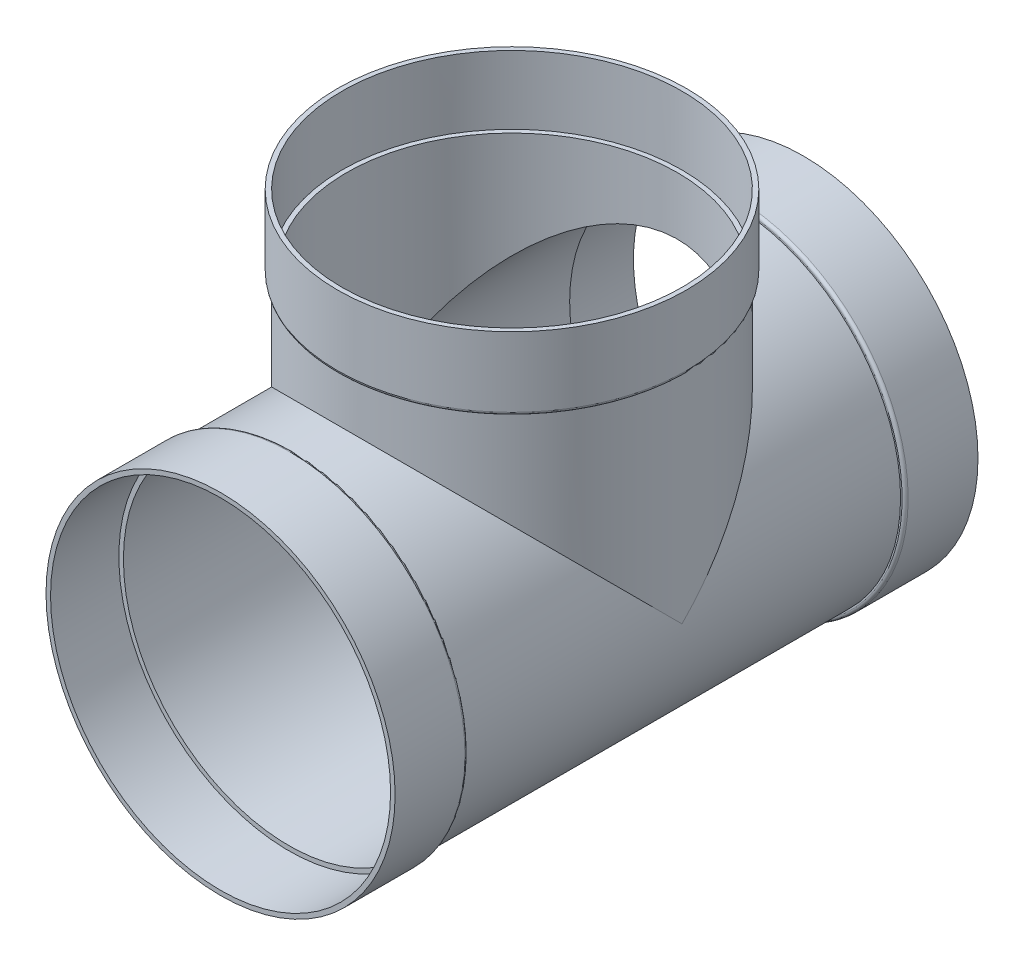
ISO-10303-21;
HEADER;
FILE_DESCRIPTION(('STEP AP214'),'2;1');
FILE_NAME('part.step','',(''),(''),'','','');
FILE_SCHEMA(('AUTOMOTIVE_DESIGN { 1 0 10303 214 1 1 1 1 }'));
ENDSEC;
DATA;
#1=APPLICATION_CONTEXT('core data for automotive mechanical design processes');
#2=APPLICATION_PROTOCOL_DEFINITION('international standard','automotive_design',2000,#1);
#3=PRODUCT_CONTEXT('',#1,'mechanical');
#4=PRODUCT('Part','Part','',(#3));
#5=PRODUCT_RELATED_PRODUCT_CATEGORY('part','',(#4));
#6=PRODUCT_DEFINITION_FORMATION('','',#4);
#7=PRODUCT_DEFINITION_CONTEXT('part definition',#1,'design');
#8=PRODUCT_DEFINITION('design','',#6,#7);
#9=PRODUCT_DEFINITION_SHAPE('','',#8);
#10=(LENGTH_UNIT() NAMED_UNIT(*) SI_UNIT(.MILLI.,.METRE.));
#11=(NAMED_UNIT(*) PLANE_ANGLE_UNIT() SI_UNIT($,.RADIAN.));
#12=(NAMED_UNIT(*) SI_UNIT($,.STERADIAN.) SOLID_ANGLE_UNIT());
#13=UNCERTAINTY_MEASURE_WITH_UNIT(LENGTH_MEASURE(1.E-05),#10,'distance_accuracy_value','');
#14=(GEOMETRIC_REPRESENTATION_CONTEXT(3) GLOBAL_UNCERTAINTY_ASSIGNED_CONTEXT((#13)) GLOBAL_UNIT_ASSIGNED_CONTEXT((#10,
#11,#12)) REPRESENTATION_CONTEXT('',''));
#15=CARTESIAN_POINT('',(0.,0.,0.));
#16=DIRECTION('',(0.,0.,1.));
#17=DIRECTION('',(1.,0.,0.));
#18=AXIS2_PLACEMENT_3D('',#15,#16,#17);
#19=CARTESIAN_POINT('',(0.,0.,304.8));
#20=DIRECTION('',(0.,0.,-1.));
#21=DIRECTION('',(-1.,0.,0.));
#22=AXIS2_PLACEMENT_3D('',#19,#20,#21);
#23=PLANE('',#22);
#24=CARTESIAN_POINT('',(0.,0.,304.8));
#25=DIRECTION('',(0.,0.,-1.));
#26=DIRECTION('',(-1.,0.,0.));
#27=AXIS2_PLACEMENT_3D('',#24,#25,#26);
#28=CIRCLE('',#27,177.8);
#29=CARTESIAN_POINT('',(-177.8,0.,304.8));
#30=VERTEX_POINT('',#29);
#31=EDGE_CURVE('E85',#30,#30,#28,.F.);
#32=ORIENTED_EDGE('',*,*,#31,.F.);
#33=EDGE_LOOP('',(#32));
#34=FACE_BOUND('',#33,.T.);
#35=CARTESIAN_POINT('',(0.,0.,304.8));
#36=DIRECTION('',(0.,0.,1.));
#37=DIRECTION('',(1.,0.,0.));
#38=AXIS2_PLACEMENT_3D('',#35,#36,#37);
#39=CIRCLE('',#38,182.5498);
#40=CARTESIAN_POINT('',(182.5498,0.,304.8));
#41=VERTEX_POINT('',#40);
#42=EDGE_CURVE('E142',#41,#41,#39,.T.);
#43=ORIENTED_EDGE('',*,*,#42,.T.);
#44=EDGE_LOOP('',(#43));
#45=FACE_BOUND('',#44,.T.);
#46=ADVANCED_FACE('F52',(#34,#45),#23,.F.);
#47=CARTESIAN_POINT('',(0.,0.,168.70511138535));
#48=DIRECTION('',(0.,0.,1.));
#49=DIRECTION('',(1.,0.,0.));
#50=AXIS2_PLACEMENT_3D('',#47,#48,#49);
#51=CYLINDRICAL_SURFACE('',#50,182.5498);
#52=CARTESIAN_POINT('',(0.,0.,231.775));
#53=DIRECTION('',(0.,0.,1.));
#54=DIRECTION('',(1.,0.,0.));
#55=AXIS2_PLACEMENT_3D('',#52,#53,#54);
#56=CIRCLE('',#55,182.5498);
#57=CARTESIAN_POINT('',(182.5498,0.,231.775));
#58=VERTEX_POINT('',#57);
#59=EDGE_CURVE('E158',#58,#58,#56,.T.);
#60=ORIENTED_EDGE('',*,*,#59,.T.);
#61=EDGE_LOOP('',(#60));
#62=FACE_BOUND('',#61,.T.);
#63=ORIENTED_EDGE('',*,*,#42,.F.);
#64=EDGE_LOOP('',(#63));
#65=FACE_BOUND('',#64,.T.);
#66=ADVANCED_FACE('F183',(#62,#65),#51,.T.);
#67=CARTESIAN_POINT('',(0.,182.5498,228.6));
#68=DIRECTION('',(0.,0.,1.));
#69=DIRECTION('',(1.,0.,0.));
#70=AXIS2_PLACEMENT_3D('',#67,#68,#69);
#71=PLANE('',#70);
#72=CARTESIAN_POINT('',(0.,0.,228.6));
#73=DIRECTION('',(0.,0.,1.));
#74=DIRECTION('',(1.,0.,0.));
#75=AXIS2_PLACEMENT_3D('',#72,#73,#74);
#76=CIRCLE('',#75,179.3748);
#77=CARTESIAN_POINT('',(179.3748,0.,228.6));
#78=VERTEX_POINT('',#77);
#79=EDGE_CURVE('E162',#78,#78,#76,.F.);
#80=ORIENTED_EDGE('',*,*,#79,.T.);
#81=EDGE_LOOP('',(#80));
#82=FACE_BOUND('',#81,.T.);
#83=CARTESIAN_POINT('',(0.,0.,228.6));
#84=DIRECTION('',(0.,0.,1.));
#85=DIRECTION('',(1.,0.,0.));
#86=AXIS2_PLACEMENT_3D('',#83,#84,#85);
#87=CIRCLE('',#86,177.8);
#88=CARTESIAN_POINT('',(177.8,0.,228.6));
#89=VERTEX_POINT('',#88);
#90=EDGE_CURVE('E138',#89,#89,#87,.T.);
#91=ORIENTED_EDGE('',*,*,#90,.T.);
#92=EDGE_LOOP('',(#91));
#93=FACE_BOUND('',#92,.T.);
#94=ADVANCED_FACE('F189',(#82,#93),#71,.F.);
#95=CARTESIAN_POINT('',(0.,0.,168.70511138535));
#96=DIRECTION('',(0.,0.,1.));
#97=DIRECTION('',(1.,0.,0.));
#98=AXIS2_PLACEMENT_3D('',#95,#96,#97);
#99=CYLINDRICAL_SURFACE('',#98,177.8);
#100=CARTESIAN_POINT('',(0.,0.,0.));
#101=DIRECTION('',(0.,-0.707106781186547,0.707106781186547));
#102=DIRECTION('',(0.,0.707106781186547,0.707106781186547));
#103=AXIS2_PLACEMENT_3D('',#100,#101,#102);
#104=ELLIPSE('',#103,251.447171389936,177.8);
#105=CARTESIAN_POINT('',(177.8,0.,0.));
#106=VERTEX_POINT('',#105);
#107=CARTESIAN_POINT('',(-177.8,0.,0.));
#108=VERTEX_POINT('',#107);
#109=EDGE_CURVE('E70',#106,#108,#104,.T.);
#110=ORIENTED_EDGE('',*,*,#109,.T.);
#111=CARTESIAN_POINT('',(0.,0.,0.));
#112=DIRECTION('',(0.,0.707106781186547,0.707106781186547));
#113=DIRECTION('',(0.,-0.707106781186547,0.707106781186547));
#114=AXIS2_PLACEMENT_3D('',#111,#112,#113);
#115=ELLIPSE('',#114,251.447171389936,177.8);
#116=EDGE_CURVE('E67',#108,#106,#115,.F.);
#117=ORIENTED_EDGE('',*,*,#116,.T.);
#118=EDGE_LOOP('',(#110,#117));
#119=FACE_BOUND('',#118,.T.);
#120=ORIENTED_EDGE('',*,*,#90,.F.);
#121=EDGE_LOOP('',(#120));
#122=FACE_BOUND('',#121,.T.);
#123=CARTESIAN_POINT('',(0.,0.,-228.6));
#124=DIRECTION('',(0.,0.,1.));
#125=DIRECTION('',(1.,0.,0.));
#126=AXIS2_PLACEMENT_3D('',#123,#124,#125);
#127=CIRCLE('',#126,177.8);
#128=CARTESIAN_POINT('',(177.8,0.,-228.6));
#129=VERTEX_POINT('',#128);
#130=EDGE_CURVE('E134',#129,#129,#127,.T.);
#131=ORIENTED_EDGE('',*,*,#130,.T.);
#132=EDGE_LOOP('',(#131));
#133=FACE_BOUND('',#132,.T.);
#134=ADVANCED_FACE('F213',(#119,#122,#133),#99,.T.);
#135=CARTESIAN_POINT('',(0.,182.5498,-228.6));
#136=DIRECTION('',(0.,0.,-1.));
#137=DIRECTION('',(-1.,0.,0.));
#138=AXIS2_PLACEMENT_3D('',#135,#136,#137);
#139=PLANE('',#138);
#140=CARTESIAN_POINT('',(0.,0.,-228.6));
#141=DIRECTION('',(0.,0.,-1.));
#142=DIRECTION('',(-1.,0.,0.));
#143=AXIS2_PLACEMENT_3D('',#140,#141,#142);
#144=CIRCLE('',#143,179.3748);
#145=CARTESIAN_POINT('',(-179.3748,0.,-228.6));
#146=VERTEX_POINT('',#145);
#147=EDGE_CURVE('E150',#146,#146,#144,.F.);
#148=ORIENTED_EDGE('',*,*,#147,.T.);
#149=EDGE_LOOP('',(#148));
#150=FACE_BOUND('',#149,.T.);
#151=ORIENTED_EDGE('',*,*,#130,.F.);
#152=EDGE_LOOP('',(#151));
#153=FACE_BOUND('',#152,.T.);
#154=ADVANCED_FACE('F209',(#150,#153),#139,.F.);
#155=CARTESIAN_POINT('',(0.,0.,168.70511138535));
#156=DIRECTION('',(0.,0.,1.));
#157=DIRECTION('',(1.,0.,0.));
#158=AXIS2_PLACEMENT_3D('',#155,#156,#157);
#159=CYLINDRICAL_SURFACE('',#158,182.5498);
#160=CARTESIAN_POINT('',(0.,0.,-231.775));
#161=DIRECTION('',(0.,0.,-1.));
#162=DIRECTION('',(-1.,0.,0.));
#163=AXIS2_PLACEMENT_3D('',#160,#161,#162);
#164=CIRCLE('',#163,182.5498);
#165=CARTESIAN_POINT('',(-182.5498,0.,-231.775));
#166=VERTEX_POINT('',#165);
#167=EDGE_CURVE('E154',#166,#166,#164,.T.);
#168=ORIENTED_EDGE('',*,*,#167,.T.);
#169=EDGE_LOOP('',(#168));
#170=FACE_BOUND('',#169,.T.);
#171=CARTESIAN_POINT('',(0.,0.,-304.8));
#172=DIRECTION('',(0.,0.,1.));
#173=DIRECTION('',(1.,0.,0.));
#174=AXIS2_PLACEMENT_3D('',#171,#172,#173);
#175=CIRCLE('',#174,182.5498);
#176=CARTESIAN_POINT('',(182.5498,0.,-304.8));
#177=VERTEX_POINT('',#176);
#178=EDGE_CURVE('E130',#177,#177,#175,.T.);
#179=ORIENTED_EDGE('',*,*,#178,.T.);
#180=EDGE_LOOP('',(#179));
#181=FACE_BOUND('',#180,.T.);
#182=ADVANCED_FACE('F212',(#170,#181),#159,.T.);
#183=CARTESIAN_POINT('',(0.,182.5498,-304.8));
#184=DIRECTION('',(0.,0.,1.));
#185=DIRECTION('',(1.,0.,0.));
#186=AXIS2_PLACEMENT_3D('',#183,#184,#185);
#187=PLANE('',#186);
#188=CARTESIAN_POINT('',(0.,0.,-304.8));
#189=DIRECTION('',(0.,0.,1.));
#190=DIRECTION('',(1.,0.,0.));
#191=AXIS2_PLACEMENT_3D('',#188,#189,#190);
#192=CIRCLE('',#191,177.8);
#193=CARTESIAN_POINT('',(177.8,0.,-304.8));
#194=VERTEX_POINT('',#193);
#195=EDGE_CURVE('E107',#194,#194,#192,.T.);
#196=ORIENTED_EDGE('',*,*,#195,.T.);
#197=EDGE_LOOP('',(#196));
#198=FACE_BOUND('',#197,.T.);
#199=ORIENTED_EDGE('',*,*,#178,.F.);
#200=EDGE_LOOP('',(#199));
#201=FACE_BOUND('',#200,.T.);
#202=ADVANCED_FACE('F228',(#198,#201),#187,.F.);
#203=CARTESIAN_POINT('',(0.,0.,0.));
#204=DIRECTION('',(0.,1.,0.));
#205=DIRECTION('',(0.,0.,1.));
#206=AXIS2_PLACEMENT_3D('',#203,#204,#205);
#207=CYLINDRICAL_SURFACE('',#206,177.8);
#208=CARTESIAN_POINT('',(0.,228.6,0.));
#209=DIRECTION('',(0.,1.,0.));
#210=DIRECTION('',(0.,0.,1.));
#211=AXIS2_PLACEMENT_3D('',#208,#209,#210);
#212=CIRCLE('',#211,177.8);
#213=CARTESIAN_POINT('',(0.,228.6,177.8));
#214=VERTEX_POINT('',#213);
#215=EDGE_CURVE('E89',#214,#214,#212,.T.);
#216=ORIENTED_EDGE('',*,*,#215,.F.);
#217=EDGE_LOOP('',(#216));
#218=FACE_BOUND('',#217,.T.);
#219=ORIENTED_EDGE('',*,*,#116,.F.);
#220=ORIENTED_EDGE('',*,*,#109,.F.);
#221=EDGE_LOOP('',(#219,#220));
#222=FACE_BOUND('',#221,.T.);
#223=ADVANCED_FACE('F232',(#218,#222),#207,.T.);
#224=CARTESIAN_POINT('',(0.,304.8,0.));
#225=DIRECTION('',(0.,1.,0.));
#226=DIRECTION('',(0.,0.,1.));
#227=AXIS2_PLACEMENT_3D('',#224,#225,#226);
#228=PLANE('',#227);
#229=CARTESIAN_POINT('',(0.,304.8,0.));
#230=DIRECTION('',(0.,1.,0.));
#231=DIRECTION('',(0.,0.,1.));
#232=AXIS2_PLACEMENT_3D('',#229,#230,#231);
#233=CIRCLE('',#232,177.8);
#234=CARTESIAN_POINT('',(0.,304.8,177.8));
#235=VERTEX_POINT('',#234);
#236=EDGE_CURVE('E116',#235,#235,#233,.T.);
#237=ORIENTED_EDGE('',*,*,#236,.F.);
#238=EDGE_LOOP('',(#237));
#239=FACE_BOUND('',#238,.T.);
#240=CARTESIAN_POINT('',(0.,304.8,0.));
#241=DIRECTION('',(0.,1.,0.));
#242=DIRECTION('',(0.,0.,1.));
#243=AXIS2_PLACEMENT_3D('',#240,#241,#242);
#244=CIRCLE('',#243,182.5498);
#245=CARTESIAN_POINT('',(0.,304.8,182.5498));
#246=VERTEX_POINT('',#245);
#247=EDGE_CURVE('E94',#246,#246,#244,.T.);
#248=ORIENTED_EDGE('',*,*,#247,.T.);
#249=EDGE_LOOP('',(#248));
#250=FACE_BOUND('',#249,.T.);
#251=ADVANCED_FACE('F234',(#239,#250),#228,.T.);
#252=CARTESIAN_POINT('',(0.,0.,0.));
#253=DIRECTION('',(0.,1.,0.));
#254=DIRECTION('',(0.,0.,1.));
#255=AXIS2_PLACEMENT_3D('',#252,#253,#254);
#256=CYLINDRICAL_SURFACE('',#255,182.5498);
#257=CARTESIAN_POINT('',(0.,231.775,0.));
#258=DIRECTION('',(0.,-1.,0.));
#259=DIRECTION('',(0.,0.,-1.));
#260=AXIS2_PLACEMENT_3D('',#257,#258,#259);
#261=CIRCLE('',#260,182.5498);
#262=CARTESIAN_POINT('',(0.,231.775,-182.5498));
#263=VERTEX_POINT('',#262);
#264=EDGE_CURVE('E61',#263,#263,#261,.F.);
#265=ORIENTED_EDGE('',*,*,#264,.T.);
#266=EDGE_LOOP('',(#265));
#267=FACE_BOUND('',#266,.T.);
#268=ORIENTED_EDGE('',*,*,#247,.F.);
#269=EDGE_LOOP('',(#268));
#270=FACE_BOUND('',#269,.T.);
#271=ADVANCED_FACE('F170',(#267,#270),#256,.T.);
#272=CARTESIAN_POINT('',(0.,228.6,182.5498));
#273=DIRECTION('',(0.,-1.,0.));
#274=DIRECTION('',(0.,0.,-1.));
#275=AXIS2_PLACEMENT_3D('',#272,#273,#274);
#276=PLANE('',#275);
#277=CARTESIAN_POINT('',(0.,228.6,0.));
#278=DIRECTION('',(0.,-1.,0.));
#279=DIRECTION('',(0.,0.,-1.));
#280=AXIS2_PLACEMENT_3D('',#277,#278,#279);
#281=CIRCLE('',#280,179.3748);
#282=CARTESIAN_POINT('',(0.,228.6,-179.3748));
#283=VERTEX_POINT('',#282);
#284=EDGE_CURVE('E13',#283,#283,#281,.T.);
#285=ORIENTED_EDGE('',*,*,#284,.T.);
#286=EDGE_LOOP('',(#285));
#287=FACE_BOUND('',#286,.T.);
#288=ORIENTED_EDGE('',*,*,#215,.T.);
#289=EDGE_LOOP('',(#288));
#290=FACE_BOUND('',#289,.T.);
#291=ADVANCED_FACE('F240',(#287,#290),#276,.T.);
#292=CARTESIAN_POINT('',(0.,0.,168.70511138535));
#293=DIRECTION('',(0.,0.,1.));
#294=DIRECTION('',(1.,0.,0.));
#295=AXIS2_PLACEMENT_3D('',#292,#293,#294);
#296=CYLINDRICAL_SURFACE('',#295,177.8);
#297=ORIENTED_EDGE('',*,*,#31,.T.);
#298=EDGE_LOOP('',(#297));
#299=FACE_BOUND('',#298,.T.);
#300=CARTESIAN_POINT('',(0.,0.,233.3498));
#301=DIRECTION('',(0.,0.,1.));
#302=DIRECTION('',(1.,0.,0.));
#303=AXIS2_PLACEMENT_3D('',#300,#301,#302);
#304=CIRCLE('',#303,177.8);
#305=CARTESIAN_POINT('',(177.8,0.,233.3498));
#306=VERTEX_POINT('',#305);
#307=EDGE_CURVE('E120',#306,#306,#304,.T.);
#308=ORIENTED_EDGE('',*,*,#307,.F.);
#309=EDGE_LOOP('',(#308));
#310=FACE_BOUND('',#309,.T.);
#311=ADVANCED_FACE('F243',(#299,#310),#296,.F.);
#312=CARTESIAN_POINT('',(0.,182.5498,233.3498));
#313=DIRECTION('',(0.,0.,1.));
#314=DIRECTION('',(1.,0.,0.));
#315=AXIS2_PLACEMENT_3D('',#312,#313,#314);
#316=PLANE('',#315);
#317=ORIENTED_EDGE('',*,*,#307,.T.);
#318=EDGE_LOOP('',(#317));
#319=FACE_BOUND('',#318,.T.);
#320=CARTESIAN_POINT('',(0.,0.,233.3498));
#321=DIRECTION('',(0.,0.,1.));
#322=DIRECTION('',(1.,0.,0.));
#323=AXIS2_PLACEMENT_3D('',#320,#321,#322);
#324=CIRCLE('',#323,173.0502);
#325=CARTESIAN_POINT('',(173.0502,0.,233.3498));
#326=VERTEX_POINT('',#325);
#327=EDGE_CURVE('E102',#326,#326,#324,.T.);
#328=ORIENTED_EDGE('',*,*,#327,.F.);
#329=EDGE_LOOP('',(#328));
#330=FACE_BOUND('',#329,.T.);
#331=ADVANCED_FACE('F264',(#319,#330),#316,.T.);
#332=CARTESIAN_POINT('',(0.,0.,168.70511138535));
#333=DIRECTION('',(0.,0.,1.));
#334=DIRECTION('',(1.,0.,0.));
#335=AXIS2_PLACEMENT_3D('',#332,#333,#334);
#336=CYLINDRICAL_SURFACE('',#335,173.0502);
#337=CARTESIAN_POINT('',(0.,0.,0.));
#338=DIRECTION('',(0.,-0.707106781186547,0.707106781186547));
#339=DIRECTION('',(0.,0.707106781186547,0.707106781186547));
#340=AXIS2_PLACEMENT_3D('',#337,#338,#339);
#341=ELLIPSE('',#340,244.729939811377,173.0502);
#342=CARTESIAN_POINT('',(173.0502,0.,0.));
#343=VERTEX_POINT('',#342);
#344=CARTESIAN_POINT('',(-173.0502,0.,0.));
#345=VERTEX_POINT('',#344);
#346=EDGE_CURVE('E78',#343,#345,#341,.T.);
#347=ORIENTED_EDGE('',*,*,#346,.F.);
#348=CARTESIAN_POINT('',(0.,0.,0.));
#349=DIRECTION('',(0.,0.707106781186547,0.707106781186547));
#350=DIRECTION('',(0.,-0.707106781186547,0.707106781186547));
#351=AXIS2_PLACEMENT_3D('',#348,#349,#350);
#352=ELLIPSE('',#351,244.729939811377,173.0502);
#353=EDGE_CURVE('E82',#345,#343,#352,.F.);
#354=ORIENTED_EDGE('',*,*,#353,.F.);
#355=EDGE_LOOP('',(#347,#354));
#356=FACE_BOUND('',#355,.T.);
#357=ORIENTED_EDGE('',*,*,#327,.T.);
#358=EDGE_LOOP('',(#357));
#359=FACE_BOUND('',#358,.T.);
#360=CARTESIAN_POINT('',(0.,0.,-233.3498));
#361=DIRECTION('',(0.,0.,-1.));
#362=DIRECTION('',(-1.,0.,0.));
#363=AXIS2_PLACEMENT_3D('',#360,#361,#362);
#364=CIRCLE('',#363,173.0502);
#365=CARTESIAN_POINT('',(-173.0502,0.,-233.3498));
#366=VERTEX_POINT('',#365);
#367=EDGE_CURVE('E98',#366,#366,#364,.F.);
#368=ORIENTED_EDGE('',*,*,#367,.F.);
#369=EDGE_LOOP('',(#368));
#370=FACE_BOUND('',#369,.T.);
#371=ADVANCED_FACE('F80',(#356,#359,#370),#336,.F.);
#372=CARTESIAN_POINT('',(0.,182.5498,-233.3498));
#373=DIRECTION('',(0.,0.,-1.));
#374=DIRECTION('',(-1.,0.,0.));
#375=AXIS2_PLACEMENT_3D('',#372,#373,#374);
#376=PLANE('',#375);
#377=ORIENTED_EDGE('',*,*,#367,.T.);
#378=EDGE_LOOP('',(#377));
#379=FACE_BOUND('',#378,.T.);
#380=CARTESIAN_POINT('',(0.,0.,-233.3498));
#381=DIRECTION('',(0.,0.,-1.));
#382=DIRECTION('',(-1.,0.,0.));
#383=AXIS2_PLACEMENT_3D('',#380,#381,#382);
#384=CIRCLE('',#383,177.8);
#385=CARTESIAN_POINT('',(-177.8,0.,-233.3498));
#386=VERTEX_POINT('',#385);
#387=EDGE_CURVE('E103',#386,#386,#384,.F.);
#388=ORIENTED_EDGE('',*,*,#387,.F.);
#389=EDGE_LOOP('',(#388));
#390=FACE_BOUND('',#389,.T.);
#391=ADVANCED_FACE('F257',(#379,#390),#376,.T.);
#392=CARTESIAN_POINT('',(0.,0.,168.70511138535));
#393=DIRECTION('',(0.,0.,1.));
#394=DIRECTION('',(1.,0.,0.));
#395=AXIS2_PLACEMENT_3D('',#392,#393,#394);
#396=CYLINDRICAL_SURFACE('',#395,177.8);
#397=ORIENTED_EDGE('',*,*,#387,.T.);
#398=EDGE_LOOP('',(#397));
#399=FACE_BOUND('',#398,.T.);
#400=ORIENTED_EDGE('',*,*,#195,.F.);
#401=EDGE_LOOP('',(#400));
#402=FACE_BOUND('',#401,.T.);
#403=ADVANCED_FACE('F253',(#399,#402),#396,.F.);
#404=CARTESIAN_POINT('',(0.,0.,0.));
#405=DIRECTION('',(0.,1.,0.));
#406=DIRECTION('',(0.,0.,1.));
#407=AXIS2_PLACEMENT_3D('',#404,#405,#406);
#408=CYLINDRICAL_SURFACE('',#407,173.0502);
#409=CARTESIAN_POINT('',(0.,233.3498,0.));
#410=DIRECTION('',(0.,-1.,0.));
#411=DIRECTION('',(0.,0.,-1.));
#412=AXIS2_PLACEMENT_3D('',#409,#410,#411);
#413=CIRCLE('',#412,173.0502);
#414=CARTESIAN_POINT('',(0.,233.3498,-173.0502));
#415=VERTEX_POINT('',#414);
#416=EDGE_CURVE('E108',#415,#415,#413,.F.);
#417=ORIENTED_EDGE('',*,*,#416,.T.);
#418=EDGE_LOOP('',(#417));
#419=FACE_BOUND('',#418,.T.);
#420=ORIENTED_EDGE('',*,*,#353,.T.);
#421=ORIENTED_EDGE('',*,*,#346,.T.);
#422=EDGE_LOOP('',(#420,#421));
#423=FACE_BOUND('',#422,.T.);
#424=ADVANCED_FACE('F87',(#419,#423),#408,.F.);
#425=CARTESIAN_POINT('',(0.,0.,0.));
#426=DIRECTION('',(0.,1.,0.));
#427=DIRECTION('',(0.,0.,1.));
#428=AXIS2_PLACEMENT_3D('',#425,#426,#427);
#429=CYLINDRICAL_SURFACE('',#428,177.8);
#430=CARTESIAN_POINT('',(0.,233.3498,0.));
#431=DIRECTION('',(0.,-1.,0.));
#432=DIRECTION('',(0.,0.,-1.));
#433=AXIS2_PLACEMENT_3D('',#430,#431,#432);
#434=CIRCLE('',#433,177.8);
#435=CARTESIAN_POINT('',(0.,233.3498,-177.8));
#436=VERTEX_POINT('',#435);
#437=EDGE_CURVE('E112',#436,#436,#434,.F.);
#438=ORIENTED_EDGE('',*,*,#437,.F.);
#439=EDGE_LOOP('',(#438));
#440=FACE_BOUND('',#439,.T.);
#441=ORIENTED_EDGE('',*,*,#236,.T.);
#442=EDGE_LOOP('',(#441));
#443=FACE_BOUND('',#442,.T.);
#444=ADVANCED_FACE('F202',(#440,#443),#429,.F.);
#445=CARTESIAN_POINT('',(0.,233.3498,182.5498));
#446=DIRECTION('',(0.,-1.,0.));
#447=DIRECTION('',(0.,0.,-1.));
#448=AXIS2_PLACEMENT_3D('',#445,#446,#447);
#449=PLANE('',#448);
#450=ORIENTED_EDGE('',*,*,#416,.F.);
#451=EDGE_LOOP('',(#450));
#452=FACE_BOUND('',#451,.T.);
#453=ORIENTED_EDGE('',*,*,#437,.T.);
#454=EDGE_LOOP('',(#453));
#455=FACE_BOUND('',#454,.T.);
#456=ADVANCED_FACE('F197',(#452,#455),#449,.F.);
#457=CARTESIAN_POINT('',(0.,0.,-231.775));
#458=DIRECTION('',(0.,0.,-1.));
#459=DIRECTION('',(-1.,0.,0.));
#460=AXIS2_PLACEMENT_3D('',#457,#458,#459);
#461=TOROIDAL_SURFACE('',#460,179.3748,3.175);
#462=ORIENTED_EDGE('',*,*,#167,.F.);
#463=EDGE_LOOP('',(#462));
#464=FACE_BOUND('',#463,.T.);
#465=ORIENTED_EDGE('',*,*,#147,.F.);
#466=EDGE_LOOP('',(#465));
#467=FACE_BOUND('',#466,.T.);
#468=ADVANCED_FACE('F179',(#464,#467),#461,.T.);
#469=CARTESIAN_POINT('',(0.,0.,231.775));
#470=DIRECTION('',(0.,0.,1.));
#471=DIRECTION('',(1.,0.,0.));
#472=AXIS2_PLACEMENT_3D('',#469,#470,#471);
#473=TOROIDAL_SURFACE('',#472,179.3748,3.175);
#474=ORIENTED_EDGE('',*,*,#79,.F.);
#475=EDGE_LOOP('',(#474));
#476=FACE_BOUND('',#475,.T.);
#477=ORIENTED_EDGE('',*,*,#59,.F.);
#478=EDGE_LOOP('',(#477));
#479=FACE_BOUND('',#478,.T.);
#480=ADVANCED_FACE('F174',(#476,#479),#473,.T.);
#481=CARTESIAN_POINT('',(0.,231.775,0.));
#482=DIRECTION('',(0.,-1.,0.));
#483=DIRECTION('',(0.,0.,-1.));
#484=AXIS2_PLACEMENT_3D('',#481,#482,#483);
#485=TOROIDAL_SURFACE('',#484,179.3748,3.175);
#486=ORIENTED_EDGE('',*,*,#284,.F.);
#487=EDGE_LOOP('',(#486));
#488=FACE_BOUND('',#487,.T.);
#489=ORIENTED_EDGE('',*,*,#264,.F.);
#490=EDGE_LOOP('',(#489));
#491=FACE_BOUND('',#490,.T.);
#492=ADVANCED_FACE('F54',(#488,#491),#485,.T.);
#493=CLOSED_SHELL('',(#46,#66,#94,#134,#154,#182,#202,#223,#251,#271,#291,#311,#331,#371,#391,
#403,#424,#444,#456,#468,#480,#492));
#494=MANIFOLD_SOLID_BREP('B2',#493);
#495=ADVANCED_BREP_SHAPE_REPRESENTATION('',(#18,#494),#14);
#496=SHAPE_DEFINITION_REPRESENTATION(#9,#495);
ENDSEC;
END-ISO-10303-21;
